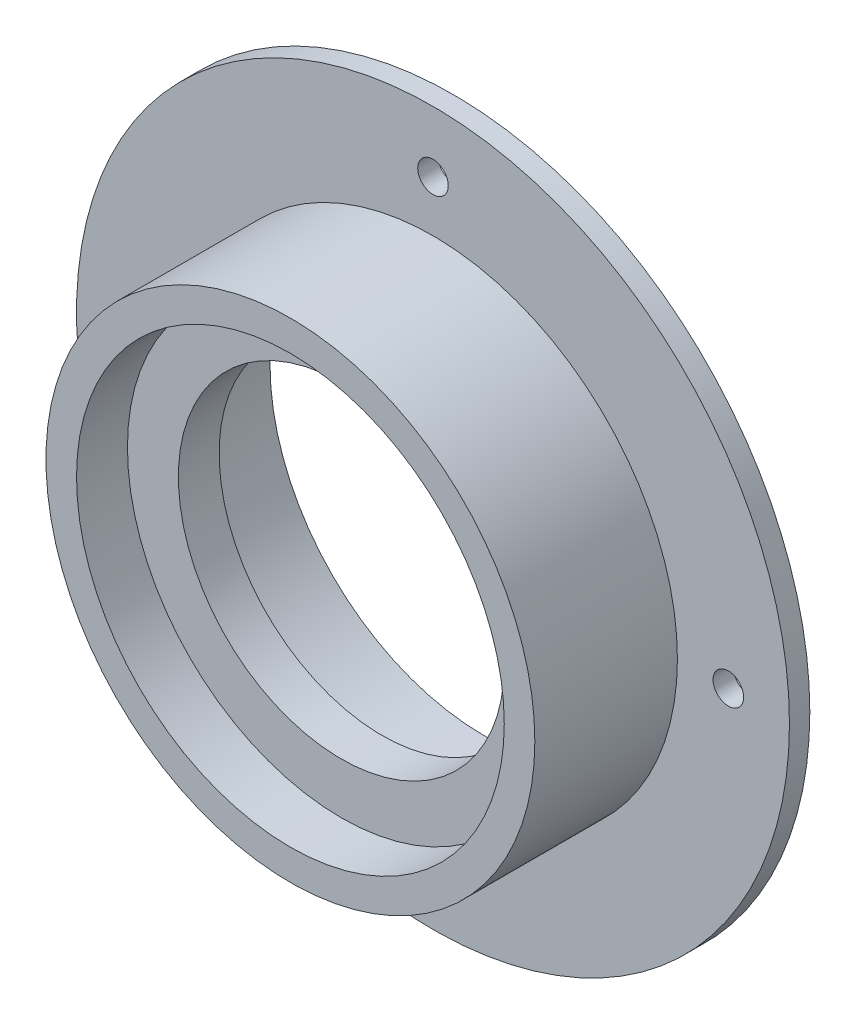
ISO-10303-21;
HEADER;
FILE_DESCRIPTION(('STEP AP214'),'2;1');
FILE_NAME('part.step','',(''),(''),'','','');
FILE_SCHEMA(('AUTOMOTIVE_DESIGN { 1 0 10303 214 1 1 1 1 }'));
ENDSEC;
DATA;
#1=APPLICATION_CONTEXT('core data for automotive mechanical design processes');
#2=APPLICATION_PROTOCOL_DEFINITION('international standard','automotive_design',2000,#1);
#3=PRODUCT_CONTEXT('',#1,'mechanical');
#4=PRODUCT('Part','Part','',(#3));
#5=PRODUCT_RELATED_PRODUCT_CATEGORY('part','',(#4));
#6=PRODUCT_DEFINITION_FORMATION('','',#4);
#7=PRODUCT_DEFINITION_CONTEXT('part definition',#1,'design');
#8=PRODUCT_DEFINITION('design','',#6,#7);
#9=PRODUCT_DEFINITION_SHAPE('','',#8);
#10=(LENGTH_UNIT() NAMED_UNIT(*) SI_UNIT(.MILLI.,.METRE.));
#11=(NAMED_UNIT(*) PLANE_ANGLE_UNIT() SI_UNIT($,.RADIAN.));
#12=(NAMED_UNIT(*) SI_UNIT($,.STERADIAN.) SOLID_ANGLE_UNIT());
#13=UNCERTAINTY_MEASURE_WITH_UNIT(LENGTH_MEASURE(1.E-05),#10,'distance_accuracy_value','');
#14=(GEOMETRIC_REPRESENTATION_CONTEXT(3) GLOBAL_UNCERTAINTY_ASSIGNED_CONTEXT((#13)) GLOBAL_UNIT_ASSIGNED_CONTEXT((#10,
#11,#12)) REPRESENTATION_CONTEXT('',''));
#15=CARTESIAN_POINT('',(0.,0.,0.));
#16=DIRECTION('',(0.,0.,1.));
#17=DIRECTION('',(1.,0.,0.));
#18=AXIS2_PLACEMENT_3D('',#15,#16,#17);
#19=CARTESIAN_POINT('',(0.,0.,0.));
#20=DIRECTION('',(0.,0.,1.));
#21=DIRECTION('',(1.,0.,0.));
#22=AXIS2_PLACEMENT_3D('',#19,#20,#21);
#23=PLANE('',#22);
#24=CARTESIAN_POINT('',(0.,0.,0.));
#25=DIRECTION('',(0.,0.,1.));
#26=DIRECTION('',(1.,0.,0.));
#27=AXIS2_PLACEMENT_3D('',#24,#25,#26);
#28=CIRCLE('',#27,35.);
#29=CARTESIAN_POINT('',(35.,0.,0.));
#30=VERTEX_POINT('',#29);
#31=EDGE_CURVE('E55',#30,#30,#28,.T.);
#32=ORIENTED_EDGE('',*,*,#31,.F.);
#33=EDGE_LOOP('',(#32));
#34=FACE_BOUND('',#33,.T.);
#35=CARTESIAN_POINT('',(0.,29.,0.));
#36=DIRECTION('',(0.,0.,-1.));
#37=DIRECTION('',(-1.,0.,0.));
#38=AXIS2_PLACEMENT_3D('',#35,#36,#37);
#39=CIRCLE('',#38,1.5);
#40=CARTESIAN_POINT('',(-1.5,29.,0.));
#41=VERTEX_POINT('',#40);
#42=EDGE_CURVE('E78',#41,#41,#39,.T.);
#43=ORIENTED_EDGE('',*,*,#42,.F.);
#44=EDGE_LOOP('',(#43));
#45=FACE_BOUND('',#44,.T.);
#46=CARTESIAN_POINT('',(29.,0.,0.));
#47=DIRECTION('',(0.,0.,-1.));
#48=DIRECTION('',(-1.,0.,0.));
#49=AXIS2_PLACEMENT_3D('',#46,#47,#48);
#50=CIRCLE('',#49,1.5);
#51=CARTESIAN_POINT('',(27.5,0.,0.));
#52=VERTEX_POINT('',#51);
#53=EDGE_CURVE('E87',#52,#52,#50,.T.);
#54=ORIENTED_EDGE('',*,*,#53,.F.);
#55=EDGE_LOOP('',(#54));
#56=FACE_BOUND('',#55,.T.);
#57=CARTESIAN_POINT('',(0.,-29.,0.));
#58=DIRECTION('',(0.,0.,-1.));
#59=DIRECTION('',(-1.,0.,0.));
#60=AXIS2_PLACEMENT_3D('',#57,#58,#59);
#61=CIRCLE('',#60,1.5);
#62=CARTESIAN_POINT('',(-1.5,-29.,0.));
#63=VERTEX_POINT('',#62);
#64=EDGE_CURVE('E95',#63,#63,#61,.T.);
#65=ORIENTED_EDGE('',*,*,#64,.F.);
#66=EDGE_LOOP('',(#65));
#67=FACE_BOUND('',#66,.T.);
#68=CARTESIAN_POINT('',(-29.,0.,0.));
#69=DIRECTION('',(0.,0.,-1.));
#70=DIRECTION('',(-1.,0.,0.));
#71=AXIS2_PLACEMENT_3D('',#68,#69,#70);
#72=CIRCLE('',#71,1.5);
#73=CARTESIAN_POINT('',(-30.5,0.,0.));
#74=VERTEX_POINT('',#73);
#75=EDGE_CURVE('E73',#74,#74,#72,.T.);
#76=ORIENTED_EDGE('',*,*,#75,.F.);
#77=EDGE_LOOP('',(#76));
#78=FACE_BOUND('',#77,.T.);
#79=CARTESIAN_POINT('',(0.,0.,0.));
#80=DIRECTION('',(0.,0.,1.));
#81=DIRECTION('',(1.,0.,0.));
#82=AXIS2_PLACEMENT_3D('',#79,#80,#81);
#83=CIRCLE('',#82,24.);
#84=CARTESIAN_POINT('',(24.,0.,0.));
#85=VERTEX_POINT('',#84);
#86=EDGE_CURVE('E10',#85,#85,#83,.F.);
#87=ORIENTED_EDGE('',*,*,#86,.F.);
#88=EDGE_LOOP('',(#87));
#89=FACE_BOUND('',#88,.T.);
#90=ADVANCED_FACE('F37',(#34,#45,#56,#67,#78,#89),#23,.F.);
#91=CARTESIAN_POINT('',(0.,0.,16.));
#92=DIRECTION('',(0.,0.,-1.));
#93=DIRECTION('',(-1.,0.,0.));
#94=AXIS2_PLACEMENT_3D('',#91,#92,#93);
#95=CYLINDRICAL_SURFACE('',#94,21.);
#96=CARTESIAN_POINT('',(0.,0.,7.));
#97=DIRECTION('',(0.,0.,1.));
#98=DIRECTION('',(1.,0.,0.));
#99=AXIS2_PLACEMENT_3D('',#96,#97,#98);
#100=CIRCLE('',#99,21.);
#101=CARTESIAN_POINT('',(21.,0.,7.));
#102=VERTEX_POINT('',#101);
#103=EDGE_CURVE('E79',#102,#102,#100,.T.);
#104=ORIENTED_EDGE('',*,*,#103,.T.);
#105=EDGE_LOOP('',(#104));
#106=FACE_BOUND('',#105,.T.);
#107=CARTESIAN_POINT('',(0.,0.,-3.));
#108=DIRECTION('',(0.,0.,-1.));
#109=DIRECTION('',(-1.,0.,0.));
#110=AXIS2_PLACEMENT_3D('',#107,#108,#109);
#111=CIRCLE('',#110,21.);
#112=CARTESIAN_POINT('',(-21.,0.,-3.));
#113=VERTEX_POINT('',#112);
#114=EDGE_CURVE('E121',#113,#113,#111,.T.);
#115=ORIENTED_EDGE('',*,*,#114,.T.);
#116=EDGE_LOOP('',(#115));
#117=FACE_BOUND('',#116,.T.);
#118=ADVANCED_FACE('F126',(#106,#117),#95,.F.);
#119=CARTESIAN_POINT('',(0.,0.,2.));
#120=DIRECTION('',(0.,0.,-1.));
#121=DIRECTION('',(-1.,0.,0.));
#122=AXIS2_PLACEMENT_3D('',#119,#120,#121);
#123=CYLINDRICAL_SURFACE('',#122,35.);
#124=CARTESIAN_POINT('',(0.,0.,2.));
#125=DIRECTION('',(0.,0.,1.));
#126=DIRECTION('',(1.,0.,0.));
#127=AXIS2_PLACEMENT_3D('',#124,#125,#126);
#128=CIRCLE('',#127,35.);
#129=CARTESIAN_POINT('',(35.,0.,2.));
#130=VERTEX_POINT('',#129);
#131=EDGE_CURVE('E50',#130,#130,#128,.T.);
#132=ORIENTED_EDGE('',*,*,#131,.F.);
#133=EDGE_LOOP('',(#132));
#134=FACE_BOUND('',#133,.T.);
#135=ORIENTED_EDGE('',*,*,#31,.T.);
#136=EDGE_LOOP('',(#135));
#137=FACE_BOUND('',#136,.T.);
#138=ADVANCED_FACE('F39',(#134,#137),#123,.T.);
#139=CARTESIAN_POINT('',(0.,0.,2.));
#140=DIRECTION('',(0.,0.,1.));
#141=DIRECTION('',(1.,0.,0.));
#142=AXIS2_PLACEMENT_3D('',#139,#140,#141);
#143=PLANE('',#142);
#144=CARTESIAN_POINT('',(-29.,0.,2.));
#145=DIRECTION('',(0.,0.,1.));
#146=DIRECTION('',(1.,0.,0.));
#147=AXIS2_PLACEMENT_3D('',#144,#145,#146);
#148=CIRCLE('',#147,1.5);
#149=CARTESIAN_POINT('',(-27.5,0.,2.));
#150=VERTEX_POINT('',#149);
#151=EDGE_CURVE('E99',#150,#150,#148,.F.);
#152=ORIENTED_EDGE('',*,*,#151,.T.);
#153=EDGE_LOOP('',(#152));
#154=FACE_BOUND('',#153,.T.);
#155=CARTESIAN_POINT('',(0.,-29.,2.));
#156=DIRECTION('',(0.,0.,1.));
#157=DIRECTION('',(1.,0.,0.));
#158=AXIS2_PLACEMENT_3D('',#155,#156,#157);
#159=CIRCLE('',#158,1.5);
#160=CARTESIAN_POINT('',(1.5,-29.,2.));
#161=VERTEX_POINT('',#160);
#162=EDGE_CURVE('E91',#161,#161,#159,.F.);
#163=ORIENTED_EDGE('',*,*,#162,.T.);
#164=EDGE_LOOP('',(#163));
#165=FACE_BOUND('',#164,.T.);
#166=CARTESIAN_POINT('',(29.,0.,2.));
#167=DIRECTION('',(0.,0.,1.));
#168=DIRECTION('',(1.,0.,0.));
#169=AXIS2_PLACEMENT_3D('',#166,#167,#168);
#170=CIRCLE('',#169,1.5);
#171=CARTESIAN_POINT('',(30.5,0.,2.));
#172=VERTEX_POINT('',#171);
#173=EDGE_CURVE('E83',#172,#172,#170,.F.);
#174=ORIENTED_EDGE('',*,*,#173,.T.);
#175=EDGE_LOOP('',(#174));
#176=FACE_BOUND('',#175,.T.);
#177=CARTESIAN_POINT('',(0.,29.,2.));
#178=DIRECTION('',(0.,0.,1.));
#179=DIRECTION('',(1.,0.,0.));
#180=AXIS2_PLACEMENT_3D('',#177,#178,#179);
#181=CIRCLE('',#180,1.5);
#182=CARTESIAN_POINT('',(1.5,29.,2.));
#183=VERTEX_POINT('',#182);
#184=EDGE_CURVE('E74',#183,#183,#181,.F.);
#185=ORIENTED_EDGE('',*,*,#184,.T.);
#186=EDGE_LOOP('',(#185));
#187=FACE_BOUND('',#186,.T.);
#188=CARTESIAN_POINT('',(0.,0.,2.));
#189=DIRECTION('',(0.,0.,1.));
#190=DIRECTION('',(1.,0.,0.));
#191=AXIS2_PLACEMENT_3D('',#188,#189,#190);
#192=CIRCLE('',#191,24.);
#193=CARTESIAN_POINT('',(24.,0.,2.));
#194=VERTEX_POINT('',#193);
#195=EDGE_CURVE('E62',#194,#194,#192,.T.);
#196=ORIENTED_EDGE('',*,*,#195,.F.);
#197=EDGE_LOOP('',(#196));
#198=FACE_BOUND('',#197,.T.);
#199=ORIENTED_EDGE('',*,*,#131,.T.);
#200=EDGE_LOOP('',(#199));
#201=FACE_BOUND('',#200,.T.);
#202=ADVANCED_FACE('F156',(#154,#165,#176,#187,#198,#201),#143,.T.);
#203=CARTESIAN_POINT('',(0.,0.,16.));
#204=DIRECTION('',(0.,0.,1.));
#205=DIRECTION('',(1.,0.,0.));
#206=AXIS2_PLACEMENT_3D('',#203,#204,#205);
#207=PLANE('',#206);
#208=CARTESIAN_POINT('',(0.,0.,16.));
#209=DIRECTION('',(0.,0.,1.));
#210=DIRECTION('',(1.,0.,0.));
#211=AXIS2_PLACEMENT_3D('',#208,#209,#210);
#212=CIRCLE('',#211,24.);
#213=CARTESIAN_POINT('',(24.,0.,16.));
#214=VERTEX_POINT('',#213);
#215=EDGE_CURVE('E60',#214,#214,#212,.T.);
#216=ORIENTED_EDGE('',*,*,#215,.T.);
#217=EDGE_LOOP('',(#216));
#218=FACE_BOUND('',#217,.T.);
#219=CARTESIAN_POINT('',(0.,0.,16.));
#220=DIRECTION('',(0.,0.,1.));
#221=DIRECTION('',(1.,0.,0.));
#222=AXIS2_PLACEMENT_3D('',#219,#220,#221);
#223=CIRCLE('',#222,21.);
#224=CARTESIAN_POINT('',(21.,0.,16.));
#225=VERTEX_POINT('',#224);
#226=EDGE_CURVE('E66',#225,#225,#223,.T.);
#227=ORIENTED_EDGE('',*,*,#226,.F.);
#228=EDGE_LOOP('',(#227));
#229=FACE_BOUND('',#228,.T.);
#230=ADVANCED_FACE('F159',(#218,#229),#207,.T.);
#231=CARTESIAN_POINT('',(0.,0.,16.));
#232=DIRECTION('',(0.,0.,-1.));
#233=DIRECTION('',(-1.,0.,0.));
#234=AXIS2_PLACEMENT_3D('',#231,#232,#233);
#235=CYLINDRICAL_SURFACE('',#234,24.);
#236=ORIENTED_EDGE('',*,*,#215,.F.);
#237=EDGE_LOOP('',(#236));
#238=FACE_BOUND('',#237,.T.);
#239=ORIENTED_EDGE('',*,*,#195,.T.);
#240=EDGE_LOOP('',(#239));
#241=FACE_BOUND('',#240,.T.);
#242=ADVANCED_FACE('F161',(#238,#241),#235,.T.);
#243=CARTESIAN_POINT('',(0.,0.,11.));
#244=DIRECTION('',(0.,0.,1.));
#245=DIRECTION('',(1.,0.,0.));
#246=AXIS2_PLACEMENT_3D('',#243,#244,#245);
#247=CIRCLE('',#246,21.);
#248=CARTESIAN_POINT('',(21.,0.,11.));
#249=VERTEX_POINT('',#248);
#250=EDGE_CURVE('E45',#249,#249,#247,.T.);
#251=ORIENTED_EDGE('',*,*,#250,.F.);
#252=EDGE_LOOP('',(#251));
#253=FACE_BOUND('',#252,.T.);
#254=ORIENTED_EDGE('',*,*,#226,.T.);
#255=EDGE_LOOP('',(#254));
#256=FACE_BOUND('',#255,.T.);
#257=ADVANCED_FACE('F152',(#253,#256),#95,.F.);
#258=CARTESIAN_POINT('',(0.,29.,16.001));
#259=DIRECTION('',(0.,0.,-1.));
#260=DIRECTION('',(-1.,0.,0.));
#261=AXIS2_PLACEMENT_3D('',#258,#259,#260);
#262=CYLINDRICAL_SURFACE('',#261,1.5);
#263=ORIENTED_EDGE('',*,*,#184,.F.);
#264=EDGE_LOOP('',(#263));
#265=FACE_BOUND('',#264,.T.);
#266=ORIENTED_EDGE('',*,*,#42,.T.);
#267=EDGE_LOOP('',(#266));
#268=FACE_BOUND('',#267,.T.);
#269=ADVANCED_FACE('F169',(#265,#268),#262,.F.);
#270=CARTESIAN_POINT('',(29.,0.,16.001));
#271=DIRECTION('',(0.,0.,-1.));
#272=DIRECTION('',(-1.,0.,0.));
#273=AXIS2_PLACEMENT_3D('',#270,#271,#272);
#274=CYLINDRICAL_SURFACE('',#273,1.5);
#275=ORIENTED_EDGE('',*,*,#173,.F.);
#276=EDGE_LOOP('',(#275));
#277=FACE_BOUND('',#276,.T.);
#278=ORIENTED_EDGE('',*,*,#53,.T.);
#279=EDGE_LOOP('',(#278));
#280=FACE_BOUND('',#279,.T.);
#281=ADVANCED_FACE('F173',(#277,#280),#274,.F.);
#282=CARTESIAN_POINT('',(0.,-29.,16.001));
#283=DIRECTION('',(0.,0.,-1.));
#284=DIRECTION('',(-1.,0.,0.));
#285=AXIS2_PLACEMENT_3D('',#282,#283,#284);
#286=CYLINDRICAL_SURFACE('',#285,1.5);
#287=ORIENTED_EDGE('',*,*,#162,.F.);
#288=EDGE_LOOP('',(#287));
#289=FACE_BOUND('',#288,.T.);
#290=ORIENTED_EDGE('',*,*,#64,.T.);
#291=EDGE_LOOP('',(#290));
#292=FACE_BOUND('',#291,.T.);
#293=ADVANCED_FACE('F177',(#289,#292),#286,.F.);
#294=CARTESIAN_POINT('',(-29.,0.,16.001));
#295=DIRECTION('',(0.,0.,-1.));
#296=DIRECTION('',(-1.,0.,0.));
#297=AXIS2_PLACEMENT_3D('',#294,#295,#296);
#298=CYLINDRICAL_SURFACE('',#297,1.5);
#299=ORIENTED_EDGE('',*,*,#151,.F.);
#300=EDGE_LOOP('',(#299));
#301=FACE_BOUND('',#300,.T.);
#302=ORIENTED_EDGE('',*,*,#75,.T.);
#303=EDGE_LOOP('',(#302));
#304=FACE_BOUND('',#303,.T.);
#305=ADVANCED_FACE('F181',(#301,#304),#298,.F.);
#306=CARTESIAN_POINT('',(0.,0.,7.));
#307=DIRECTION('',(0.,0.,1.));
#308=DIRECTION('',(1.,0.,0.));
#309=AXIS2_PLACEMENT_3D('',#306,#307,#308);
#310=PLANE('',#309);
#311=CARTESIAN_POINT('',(0.,0.,7.));
#312=DIRECTION('',(0.,0.,1.));
#313=DIRECTION('',(1.,0.,0.));
#314=AXIS2_PLACEMENT_3D('',#311,#312,#313);
#315=CIRCLE('',#314,16.);
#316=CARTESIAN_POINT('',(16.,0.,7.));
#317=VERTEX_POINT('',#316);
#318=EDGE_CURVE('E109',#317,#317,#315,.T.);
#319=ORIENTED_EDGE('',*,*,#318,.T.);
#320=EDGE_LOOP('',(#319));
#321=FACE_BOUND('',#320,.T.);
#322=ORIENTED_EDGE('',*,*,#103,.F.);
#323=EDGE_LOOP('',(#322));
#324=FACE_BOUND('',#323,.T.);
#325=ADVANCED_FACE('F185',(#321,#324),#310,.F.);
#326=CARTESIAN_POINT('',(0.,0.,11.));
#327=DIRECTION('',(0.,0.,1.));
#328=DIRECTION('',(1.,0.,0.));
#329=AXIS2_PLACEMENT_3D('',#326,#327,#328);
#330=PLANE('',#329);
#331=CARTESIAN_POINT('',(0.,0.,11.));
#332=DIRECTION('',(0.,0.,1.));
#333=DIRECTION('',(1.,0.,0.));
#334=AXIS2_PLACEMENT_3D('',#331,#332,#333);
#335=CIRCLE('',#334,16.);
#336=CARTESIAN_POINT('',(16.,0.,11.));
#337=VERTEX_POINT('',#336);
#338=EDGE_CURVE('E110',#337,#337,#335,.T.);
#339=ORIENTED_EDGE('',*,*,#338,.F.);
#340=EDGE_LOOP('',(#339));
#341=FACE_BOUND('',#340,.T.);
#342=ORIENTED_EDGE('',*,*,#250,.T.);
#343=EDGE_LOOP('',(#342));
#344=FACE_BOUND('',#343,.T.);
#345=ADVANCED_FACE('F141',(#341,#344),#330,.T.);
#346=CARTESIAN_POINT('',(0.,0.,7.));
#347=DIRECTION('',(0.,0.,1.));
#348=DIRECTION('',(1.,0.,0.));
#349=AXIS2_PLACEMENT_3D('',#346,#347,#348);
#350=CYLINDRICAL_SURFACE('',#349,16.);
#351=ORIENTED_EDGE('',*,*,#318,.F.);
#352=EDGE_LOOP('',(#351));
#353=FACE_BOUND('',#352,.T.);
#354=ORIENTED_EDGE('',*,*,#338,.T.);
#355=EDGE_LOOP('',(#354));
#356=FACE_BOUND('',#355,.T.);
#357=ADVANCED_FACE('F131',(#353,#356),#350,.F.);
#358=CARTESIAN_POINT('',(0.,0.,-3.));
#359=DIRECTION('',(0.,0.,-1.));
#360=DIRECTION('',(-1.,0.,0.));
#361=AXIS2_PLACEMENT_3D('',#358,#359,#360);
#362=PLANE('',#361);
#363=CARTESIAN_POINT('',(0.,0.,-3.));
#364=DIRECTION('',(0.,0.,-1.));
#365=DIRECTION('',(-1.,0.,0.));
#366=AXIS2_PLACEMENT_3D('',#363,#364,#365);
#367=CIRCLE('',#366,24.);
#368=CARTESIAN_POINT('',(-24.,0.,-3.));
#369=VERTEX_POINT('',#368);
#370=EDGE_CURVE('E114',#369,#369,#367,.T.);
#371=ORIENTED_EDGE('',*,*,#370,.T.);
#372=EDGE_LOOP('',(#371));
#373=FACE_BOUND('',#372,.T.);
#374=ORIENTED_EDGE('',*,*,#114,.F.);
#375=EDGE_LOOP('',(#374));
#376=FACE_BOUND('',#375,.T.);
#377=ADVANCED_FACE('F128',(#373,#376),#362,.T.);
#378=CARTESIAN_POINT('',(0.,0.,-3.));
#379=DIRECTION('',(0.,0.,1.));
#380=DIRECTION('',(1.,0.,0.));
#381=AXIS2_PLACEMENT_3D('',#378,#379,#380);
#382=CYLINDRICAL_SURFACE('',#381,24.);
#383=ORIENTED_EDGE('',*,*,#370,.F.);
#384=EDGE_LOOP('',(#383));
#385=FACE_BOUND('',#384,.T.);
#386=ORIENTED_EDGE('',*,*,#86,.T.);
#387=EDGE_LOOP('',(#386));
#388=FACE_BOUND('',#387,.T.);
#389=ADVANCED_FACE('F130',(#385,#388),#382,.T.);
#390=CLOSED_SHELL('',(#90,#118,#138,#202,#230,#242,#257,#269,#281,#293,#305,#325,#345,#357,#377,#389));
#391=MANIFOLD_SOLID_BREP('B2',#390);
#392=ADVANCED_BREP_SHAPE_REPRESENTATION('',(#18,#391),#14);
#393=SHAPE_DEFINITION_REPRESENTATION(#9,#392);
ENDSEC;
END-ISO-10303-21;
